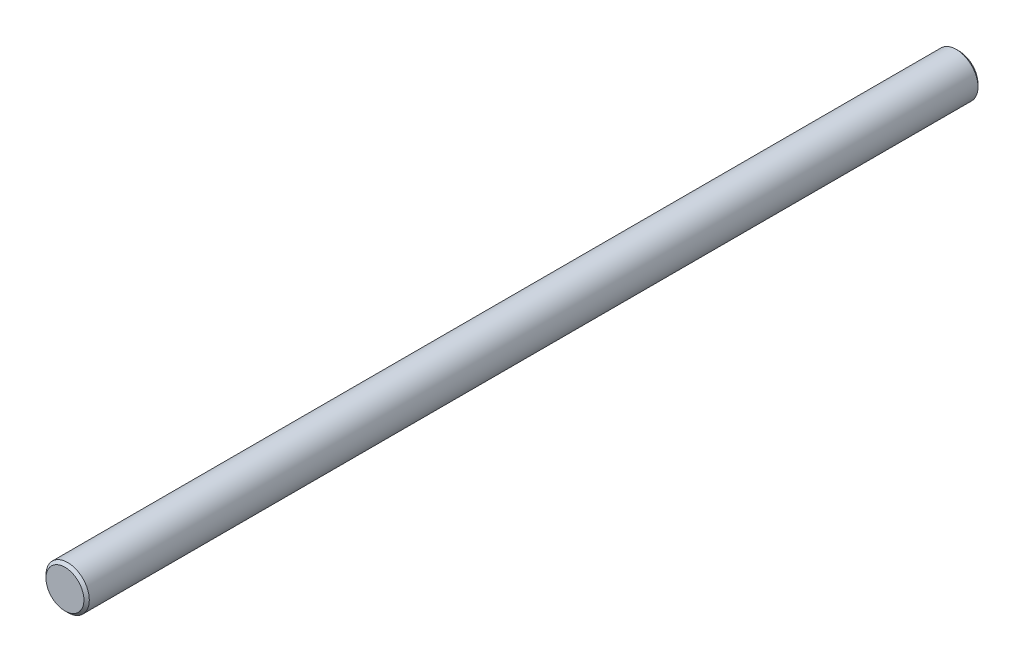
ISO-10303-21;
HEADER;
FILE_DESCRIPTION(('STEP AP214'),'2;1');
FILE_NAME('part.step','',(''),(''),'','','');
FILE_SCHEMA(('AUTOMOTIVE_DESIGN { 1 0 10303 214 1 1 1 1 }'));
ENDSEC;
DATA;
#1=APPLICATION_CONTEXT('core data for automotive mechanical design processes');
#2=APPLICATION_PROTOCOL_DEFINITION('international standard','automotive_design',2000,#1);
#3=PRODUCT_CONTEXT('',#1,'mechanical');
#4=PRODUCT('Part','Part','',(#3));
#5=PRODUCT_RELATED_PRODUCT_CATEGORY('part','',(#4));
#6=PRODUCT_DEFINITION_FORMATION('','',#4);
#7=PRODUCT_DEFINITION_CONTEXT('part definition',#1,'design');
#8=PRODUCT_DEFINITION('design','',#6,#7);
#9=PRODUCT_DEFINITION_SHAPE('','',#8);
#10=(LENGTH_UNIT() NAMED_UNIT(*) SI_UNIT(.MILLI.,.METRE.));
#11=(NAMED_UNIT(*) PLANE_ANGLE_UNIT() SI_UNIT($,.RADIAN.));
#12=(NAMED_UNIT(*) SI_UNIT($,.STERADIAN.) SOLID_ANGLE_UNIT());
#13=UNCERTAINTY_MEASURE_WITH_UNIT(LENGTH_MEASURE(1.E-05),#10,'distance_accuracy_value','');
#14=(GEOMETRIC_REPRESENTATION_CONTEXT(3) GLOBAL_UNCERTAINTY_ASSIGNED_CONTEXT((#13)) GLOBAL_UNIT_ASSIGNED_CONTEXT((#10,
#11,#12)) REPRESENTATION_CONTEXT('',''));
#15=CARTESIAN_POINT('',(0.,0.,0.));
#16=DIRECTION('',(0.,0.,1.));
#17=DIRECTION('',(1.,0.,0.));
#18=AXIS2_PLACEMENT_3D('',#15,#16,#17);
#19=CARTESIAN_POINT('',(0.,0.,165.));
#20=DIRECTION('',(0.,0.,-1.));
#21=DIRECTION('',(-1.,0.,0.));
#22=AXIS2_PLACEMENT_3D('',#19,#20,#21);
#23=CYLINDRICAL_SURFACE('',#22,4.);
#24=CARTESIAN_POINT('',(0.,0.,0.500000000000028));
#25=DIRECTION('',(0.,0.,1.));
#26=DIRECTION('',(1.,0.,0.));
#27=AXIS2_PLACEMENT_3D('',#24,#25,#26);
#28=CIRCLE('',#27,4.);
#29=CARTESIAN_POINT('',(4.,0.,0.500000000000028));
#30=VERTEX_POINT('',#29);
#31=EDGE_CURVE('E44',#30,#30,#28,.T.);
#32=ORIENTED_EDGE('',*,*,#31,.T.);
#33=EDGE_LOOP('',(#32));
#34=FACE_BOUND('',#33,.T.);
#35=CARTESIAN_POINT('',(0.,0.,164.5));
#36=DIRECTION('',(0.,0.,1.));
#37=DIRECTION('',(1.,0.,0.));
#38=AXIS2_PLACEMENT_3D('',#35,#36,#37);
#39=CIRCLE('',#38,4.);
#40=CARTESIAN_POINT('',(4.,0.,164.5));
#41=VERTEX_POINT('',#40);
#42=EDGE_CURVE('E48',#41,#41,#39,.F.);
#43=ORIENTED_EDGE('',*,*,#42,.T.);
#44=EDGE_LOOP('',(#43));
#45=FACE_BOUND('',#44,.T.);
#46=ADVANCED_FACE('F33',(#34,#45),#23,.T.);
#47=CARTESIAN_POINT('',(0.,0.,165.));
#48=DIRECTION('',(0.,0.,1.));
#49=DIRECTION('',(1.,0.,0.));
#50=AXIS2_PLACEMENT_3D('',#47,#48,#49);
#51=PLANE('',#50);
#52=CARTESIAN_POINT('',(0.,0.,165.));
#53=DIRECTION('',(0.,0.,1.));
#54=DIRECTION('',(1.,0.,0.));
#55=AXIS2_PLACEMENT_3D('',#52,#53,#54);
#56=CIRCLE('',#55,3.50000000000004);
#57=CARTESIAN_POINT('',(3.50000000000004,0.,165.));
#58=VERTEX_POINT('',#57);
#59=EDGE_CURVE('E10',#58,#58,#56,.T.);
#60=ORIENTED_EDGE('',*,*,#59,.T.);
#61=EDGE_LOOP('',(#60));
#62=FACE_BOUND('',#61,.T.);
#63=ADVANCED_FACE('F64',(#62),#51,.T.);
#64=CARTESIAN_POINT('',(0.,0.,0.));
#65=DIRECTION('',(0.,0.,1.));
#66=DIRECTION('',(1.,0.,0.));
#67=AXIS2_PLACEMENT_3D('',#64,#65,#66);
#68=PLANE('',#67);
#69=CARTESIAN_POINT('',(0.,0.,0.));
#70=DIRECTION('',(0.,0.,1.));
#71=DIRECTION('',(1.,0.,0.));
#72=AXIS2_PLACEMENT_3D('',#69,#70,#71);
#73=CIRCLE('',#72,3.49999999999998);
#74=CARTESIAN_POINT('',(3.49999999999998,0.,0.));
#75=VERTEX_POINT('',#74);
#76=EDGE_CURVE('E40',#75,#75,#73,.F.);
#77=ORIENTED_EDGE('',*,*,#76,.T.);
#78=EDGE_LOOP('',(#77));
#79=FACE_BOUND('',#78,.T.);
#80=ADVANCED_FACE('F61',(#79),#68,.F.);
#81=CARTESIAN_POINT('',(0.,0.,0.500000000000028));
#82=DIRECTION('',(0.,0.,1.));
#83=DIRECTION('',(1.,0.,0.));
#84=AXIS2_PLACEMENT_3D('',#81,#82,#83);
#85=CONICAL_SURFACE('',#84,4.,0.785398163397445);
#86=ORIENTED_EDGE('',*,*,#76,.F.);
#87=EDGE_LOOP('',(#86));
#88=FACE_BOUND('',#87,.T.);
#89=ORIENTED_EDGE('',*,*,#31,.F.);
#90=EDGE_LOOP('',(#89));
#91=FACE_BOUND('',#90,.T.);
#92=ADVANCED_FACE('F57',(#88,#91),#85,.T.);
#93=CARTESIAN_POINT('',(0.,0.,165.));
#94=DIRECTION('',(0.,0.,-1.));
#95=DIRECTION('',(-1.,0.,0.));
#96=AXIS2_PLACEMENT_3D('',#93,#94,#95);
#97=CONICAL_SURFACE('',#96,3.50000000000004,0.785398163397459);
#98=ORIENTED_EDGE('',*,*,#42,.F.);
#99=EDGE_LOOP('',(#98));
#100=FACE_BOUND('',#99,.T.);
#101=ORIENTED_EDGE('',*,*,#59,.F.);
#102=EDGE_LOOP('',(#101));
#103=FACE_BOUND('',#102,.T.);
#104=ADVANCED_FACE('F35',(#100,#103),#97,.T.);
#105=CLOSED_SHELL('',(#46,#63,#80,#92,#104));
#106=MANIFOLD_SOLID_BREP('B2',#105);
#107=ADVANCED_BREP_SHAPE_REPRESENTATION('',(#18,#106),#14);
#108=SHAPE_DEFINITION_REPRESENTATION(#9,#107);
ENDSEC;
END-ISO-10303-21;
